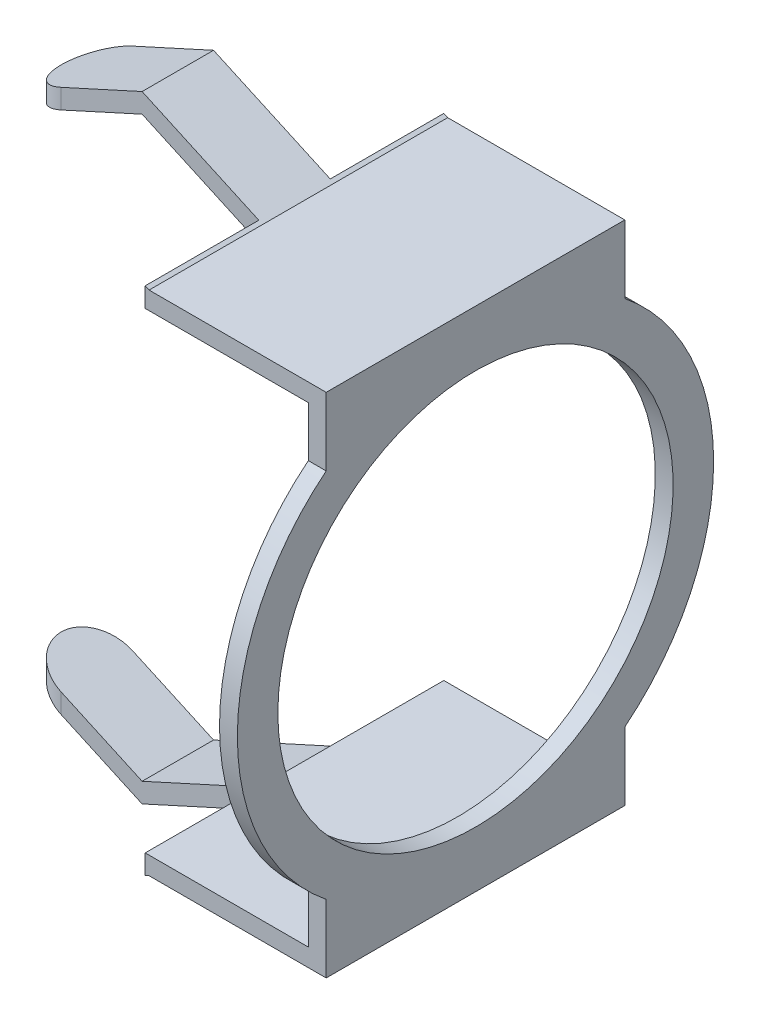
ISO-10303-21;
HEADER;
FILE_DESCRIPTION(('STEP AP214'),'2;1');
FILE_NAME('part.step','',(''),(''),'','','');
FILE_SCHEMA(('AUTOMOTIVE_DESIGN { 1 0 10303 214 1 1 1 1 }'));
ENDSEC;
DATA;
#1=APPLICATION_CONTEXT('core data for automotive mechanical design processes');
#2=APPLICATION_PROTOCOL_DEFINITION('international standard','automotive_design',2000,#1);
#3=PRODUCT_CONTEXT('',#1,'mechanical');
#4=PRODUCT('Part','Part','',(#3));
#5=PRODUCT_RELATED_PRODUCT_CATEGORY('part','',(#4));
#6=PRODUCT_DEFINITION_FORMATION('','',#4);
#7=PRODUCT_DEFINITION_CONTEXT('part definition',#1,'design');
#8=PRODUCT_DEFINITION('design','',#6,#7);
#9=PRODUCT_DEFINITION_SHAPE('','',#8);
#10=(LENGTH_UNIT() NAMED_UNIT(*) SI_UNIT(.MILLI.,.METRE.));
#11=(NAMED_UNIT(*) PLANE_ANGLE_UNIT() SI_UNIT($,.RADIAN.));
#12=(NAMED_UNIT(*) SI_UNIT($,.STERADIAN.) SOLID_ANGLE_UNIT());
#13=UNCERTAINTY_MEASURE_WITH_UNIT(LENGTH_MEASURE(1.E-05),#10,'distance_accuracy_value','');
#14=(GEOMETRIC_REPRESENTATION_CONTEXT(3) GLOBAL_UNCERTAINTY_ASSIGNED_CONTEXT((#13)) GLOBAL_UNIT_ASSIGNED_CONTEXT((#10,
#11,#12)) REPRESENTATION_CONTEXT('',''));
#15=CARTESIAN_POINT('',(0.,0.,0.));
#16=DIRECTION('',(0.,0.,1.));
#17=DIRECTION('',(1.,0.,0.));
#18=AXIS2_PLACEMENT_3D('',#15,#16,#17);
#19=CARTESIAN_POINT('',(2.025,-6.47700843453132,0.));
#20=DIRECTION('',(0.,-1.,0.));
#21=DIRECTION('',(0.,0.,-1.));
#22=AXIS2_PLACEMENT_3D('',#19,#20,#21);
#23=CYLINDRICAL_SURFACE('',#22,0.75);
#24=CARTESIAN_POINT('',(2.025,-5.70333496514356,0.));
#25=DIRECTION('',(0.414222746435424,0.910175541494878,0.));
#26=DIRECTION('',(0.910175541494878,-0.414222746435424,0.));
#27=AXIS2_PLACEMENT_3D('',#24,#25,#26);
#28=ELLIPSE('',#27,0.824016869062637,0.75);
#29=CARTESIAN_POINT('',(2.025,-5.70333496514356,-0.75));
#30=VERTEX_POINT('',#29);
#31=CARTESIAN_POINT('',(2.025,-5.70333496514356,0.75));
#32=VERTEX_POINT('',#31);
#33=EDGE_CURVE('E21',#30,#32,#28,.T.);
#34=ORIENTED_EDGE('',*,*,#33,.T.);
#35=DIRECTION('',(0.,-1.,0.));
#36=VECTOR('',#35,1.);
#37=CARTESIAN_POINT('',(2.025,-6.47700843453132,0.75));
#38=LINE('',#37,#36);
#39=CARTESIAN_POINT('',(2.025,-5.29132653061224,0.75));
#40=VERTEX_POINT('',#39);
#41=EDGE_CURVE('E187',#32,#40,#38,.F.);
#42=ORIENTED_EDGE('',*,*,#41,.T.);
#43=CARTESIAN_POINT('',(2.025,-5.29132653061224,0.));
#44=DIRECTION('',(0.414222746435424,0.910175541494878,0.));
#45=DIRECTION('',(0.910175541494878,-0.414222746435424,0.));
#46=AXIS2_PLACEMENT_3D('',#43,#44,#45);
#47=ELLIPSE('',#46,0.824016869062637,0.75);
#48=CARTESIAN_POINT('',(2.02500000000001,-5.29132653061224,-0.75));
#49=VERTEX_POINT('',#48);
#50=EDGE_CURVE('E182',#49,#40,#47,.T.);
#51=ORIENTED_EDGE('',*,*,#50,.F.);
#52=DIRECTION('',(0.,-1.,0.));
#53=VECTOR('',#52,1.);
#54=CARTESIAN_POINT('',(2.025,-6.47700843453132,-0.75));
#55=LINE('',#54,#53);
#56=EDGE_CURVE('E178',#49,#30,#55,.T.);
#57=ORIENTED_EDGE('',*,*,#56,.T.);
#58=EDGE_LOOP('',(#34,#42,#51,#57));
#59=FACE_BOUND('',#58,.T.);
#60=ADVANCED_FACE('F18',(#59),#23,.T.);
#61=CARTESIAN_POINT('',(2.025,-6.47700843453132,0.));
#62=DIRECTION('',(0.,-1.,0.));
#63=DIRECTION('',(0.,0.,-1.));
#64=AXIS2_PLACEMENT_3D('',#61,#62,#63);
#65=CYLINDRICAL_SURFACE('',#64,0.75);
#66=CARTESIAN_POINT('',(2.025,5.29132653061225,0.));
#67=DIRECTION('',(0.414222746435424,-0.910175541494878,0.));
#68=DIRECTION('',(-0.910175541494878,-0.414222746435424,0.));
#69=AXIS2_PLACEMENT_3D('',#66,#67,#68);
#70=ELLIPSE('',#69,0.824016869062637,0.75);
#71=CARTESIAN_POINT('',(2.02500000000001,5.29132653061225,0.75));
#72=VERTEX_POINT('',#71);
#73=CARTESIAN_POINT('',(2.02500000000001,5.29132653061225,-0.75));
#74=VERTEX_POINT('',#73);
#75=EDGE_CURVE('E284',#72,#74,#70,.T.);
#76=ORIENTED_EDGE('',*,*,#75,.F.);
#77=DIRECTION('',(0.,-1.,0.));
#78=VECTOR('',#77,1.);
#79=CARTESIAN_POINT('',(2.025,-6.47700843453132,0.75));
#80=LINE('',#79,#78);
#81=CARTESIAN_POINT('',(2.025,5.70333496514356,0.75));
#82=VERTEX_POINT('',#81);
#83=EDGE_CURVE('E216',#72,#82,#80,.F.);
#84=ORIENTED_EDGE('',*,*,#83,.T.);
#85=CARTESIAN_POINT('',(2.025,5.70333496514356,0.));
#86=DIRECTION('',(0.414222746435424,-0.910175541494878,0.));
#87=DIRECTION('',(-0.910175541494878,-0.414222746435424,0.));
#88=AXIS2_PLACEMENT_3D('',#85,#86,#87);
#89=ELLIPSE('',#88,0.824016869062637,0.75);
#90=CARTESIAN_POINT('',(2.025,5.70333496514356,-0.75));
#91=VERTEX_POINT('',#90);
#92=EDGE_CURVE('E289',#82,#91,#89,.T.);
#93=ORIENTED_EDGE('',*,*,#92,.T.);
#94=DIRECTION('',(0.,-1.,0.));
#95=VECTOR('',#94,1.);
#96=CARTESIAN_POINT('',(2.025,-6.47700843453132,-0.75));
#97=LINE('',#96,#95);
#98=EDGE_CURVE('E260',#91,#74,#97,.T.);
#99=ORIENTED_EDGE('',*,*,#98,.T.);
#100=EDGE_LOOP('',(#76,#84,#93,#99));
#101=FACE_BOUND('',#100,.T.);
#102=ADVANCED_FACE('F654',(#101),#65,.T.);
#103=CARTESIAN_POINT('',(1.11966647008672,-5.29131582806058,5.));
#104=DIRECTION('',(0.414222746435424,0.910175541494878,0.));
#105=DIRECTION('',(-0.910175541494878,0.414222746435424,0.));
#106=AXIS2_PLACEMENT_3D('',#103,#104,#105);
#107=PLANE('',#106);
#108=DIRECTION('',(0.910175541494878,-0.414222746435424,0.));
#109=VECTOR('',#108,1.);
#110=CARTESIAN_POINT('',(2.025,-5.70333496514356,-0.75));
#111=LINE('',#110,#109);
#112=CARTESIAN_POINT('',(3.725,-6.47700843453132,-0.750000000000001));
#113=VERTEX_POINT('',#112);
#114=EDGE_CURVE('E192',#30,#113,#111,.T.);
#115=ORIENTED_EDGE('',*,*,#114,.T.);
#116=DIRECTION('',(0.,0.,1.));
#117=VECTOR('',#116,1.);
#118=CARTESIAN_POINT('',(3.72500000000001,-6.47700843453132,5.));
#119=LINE('',#118,#117);
#120=CARTESIAN_POINT('',(3.725,-6.47700843453132,0.749999999999998));
#121=VERTEX_POINT('',#120);
#122=EDGE_CURVE('E197',#121,#113,#119,.F.);
#123=ORIENTED_EDGE('',*,*,#122,.F.);
#124=DIRECTION('',(-0.910175541494878,0.414222746435424,0.));
#125=VECTOR('',#124,1.);
#126=CARTESIAN_POINT('',(3.72500000000001,-6.47700843453132,0.75));
#127=LINE('',#126,#125);
#128=EDGE_CURVE('E195',#121,#32,#127,.T.);
#129=ORIENTED_EDGE('',*,*,#128,.T.);
#130=ORIENTED_EDGE('',*,*,#33,.F.);
#131=EDGE_LOOP('',(#115,#123,#129,#130));
#132=FACE_BOUND('',#131,.T.);
#133=ADVANCED_FACE('F191',(#132),#107,.F.);
#134=CARTESIAN_POINT('',(3.72500000000001,-6.065,5.));
#135=DIRECTION('',(-0.414222746435424,0.910175541494878,0.));
#136=DIRECTION('',(-0.910175541494878,-0.414222746435424,0.));
#137=AXIS2_PLACEMENT_3D('',#134,#135,#136);
#138=PLANE('',#137);
#139=DIRECTION('',(0.910175541494878,0.414222746435424,0.));
#140=VECTOR('',#139,1.);
#141=CARTESIAN_POINT('',(3.72500000000001,-6.065,0.75));
#142=LINE('',#141,#140);
#143=CARTESIAN_POINT('',(3.72500000000001,-6.065,0.749999999999998));
#144=VERTEX_POINT('',#143);
#145=CARTESIAN_POINT('',(6.17500000000001,-4.95,0.749999999999999));
#146=VERTEX_POINT('',#145);
#147=EDGE_CURVE('E239',#144,#146,#142,.T.);
#148=ORIENTED_EDGE('',*,*,#147,.T.);
#149=DIRECTION('',(0.,0.,1.));
#150=VECTOR('',#149,1.);
#151=CARTESIAN_POINT('',(6.17500000000001,-4.95,5.));
#152=LINE('',#151,#150);
#153=CARTESIAN_POINT('',(6.17500000000001,-4.95,-0.75));
#154=VERTEX_POINT('',#153);
#155=EDGE_CURVE('E196',#146,#154,#152,.F.);
#156=ORIENTED_EDGE('',*,*,#155,.T.);
#157=DIRECTION('',(-0.910175541494878,-0.414222746435424,0.));
#158=VECTOR('',#157,1.);
#159=CARTESIAN_POINT('',(6.17500000000001,-4.95,-0.75));
#160=LINE('',#159,#158);
#161=CARTESIAN_POINT('',(3.72500000000001,-6.065,-0.750000000000001));
#162=VERTEX_POINT('',#161);
#163=EDGE_CURVE('E205',#154,#162,#160,.T.);
#164=ORIENTED_EDGE('',*,*,#163,.T.);
#165=DIRECTION('',(0.,0.,1.));
#166=VECTOR('',#165,1.);
#167=CARTESIAN_POINT('',(3.72500000000001,-6.065,5.));
#168=LINE('',#167,#166);
#169=EDGE_CURVE('E291',#144,#162,#168,.F.);
#170=ORIENTED_EDGE('',*,*,#169,.F.);
#171=EDGE_LOOP('',(#148,#156,#164,#170));
#172=FACE_BOUND('',#171,.T.);
#173=ADVANCED_FACE('F463',(#172),#138,.T.);
#174=CARTESIAN_POINT('',(1.27500000000001,-4.95,5.));
#175=DIRECTION('',(0.414222746435424,0.910175541494878,0.));
#176=DIRECTION('',(-0.910175541494878,0.414222746435424,0.));
#177=AXIS2_PLACEMENT_3D('',#174,#175,#176);
#178=PLANE('',#177);
#179=DIRECTION('',(0.910175541494878,-0.414222746435425,0.));
#180=VECTOR('',#179,1.);
#181=CARTESIAN_POINT('',(2.025,-5.29132653061224,0.75));
#182=LINE('',#181,#180);
#183=EDGE_CURVE('E243',#40,#144,#182,.T.);
#184=ORIENTED_EDGE('',*,*,#183,.T.);
#185=ORIENTED_EDGE('',*,*,#169,.T.);
#186=DIRECTION('',(-0.910175541494878,0.414222746435425,0.));
#187=VECTOR('',#186,1.);
#188=CARTESIAN_POINT('',(3.72500000000001,-6.065,-0.75));
#189=LINE('',#188,#187);
#190=EDGE_CURVE('E382',#162,#49,#189,.T.);
#191=ORIENTED_EDGE('',*,*,#190,.T.);
#192=ORIENTED_EDGE('',*,*,#50,.T.);
#193=EDGE_LOOP('',(#184,#185,#191,#192));
#194=FACE_BOUND('',#193,.T.);
#195=ADVANCED_FACE('F465',(#194),#178,.T.);
#196=CARTESIAN_POINT('',(1.11966647008672,5.29131582806058,5.));
#197=DIRECTION('',(0.414222746435424,-0.910175541494878,0.));
#198=DIRECTION('',(0.910175541494878,0.414222746435424,0.));
#199=AXIS2_PLACEMENT_3D('',#196,#197,#198);
#200=PLANE('',#199);
#201=DIRECTION('',(-0.910175541494878,-0.414222746435424,0.));
#202=VECTOR('',#201,1.);
#203=CARTESIAN_POINT('',(3.72500000000001,6.47700843453132,-0.75));
#204=LINE('',#203,#202);
#205=CARTESIAN_POINT('',(3.72500000000001,6.47700843453132,-0.750000000000001));
#206=VERTEX_POINT('',#205);
#207=EDGE_CURVE('E414',#206,#91,#204,.T.);
#208=ORIENTED_EDGE('',*,*,#207,.T.);
#209=ORIENTED_EDGE('',*,*,#92,.F.);
#210=DIRECTION('',(0.910175541494878,0.414222746435423,0.));
#211=VECTOR('',#210,1.);
#212=CARTESIAN_POINT('',(2.025,5.70333496514356,0.75));
#213=LINE('',#212,#211);
#214=CARTESIAN_POINT('',(3.72500000000001,6.47700843453132,0.749999999999998));
#215=VERTEX_POINT('',#214);
#216=EDGE_CURVE('E419',#82,#215,#213,.T.);
#217=ORIENTED_EDGE('',*,*,#216,.T.);
#218=DIRECTION('',(0.,0.,1.));
#219=VECTOR('',#218,1.);
#220=CARTESIAN_POINT('',(3.72500000000001,6.47700843453132,5.));
#221=LINE('',#220,#219);
#222=EDGE_CURVE('E288',#206,#215,#221,.T.);
#223=ORIENTED_EDGE('',*,*,#222,.F.);
#224=EDGE_LOOP('',(#208,#209,#217,#223));
#225=FACE_BOUND('',#224,.T.);
#226=ADVANCED_FACE('F686',(#225),#200,.F.);
#227=CARTESIAN_POINT('',(1.27500000000001,4.95,5.));
#228=DIRECTION('',(0.414222746435424,-0.910175541494878,0.));
#229=DIRECTION('',(0.910175541494878,0.414222746435424,0.));
#230=AXIS2_PLACEMENT_3D('',#227,#228,#229);
#231=PLANE('',#230);
#232=DIRECTION('',(-0.910175541494878,-0.414222746435424,0.));
#233=VECTOR('',#232,1.);
#234=CARTESIAN_POINT('',(3.72500000000001,6.065,0.75));
#235=LINE('',#234,#233);
#236=CARTESIAN_POINT('',(3.72500000000001,6.065,0.749999999999998));
#237=VERTEX_POINT('',#236);
#238=EDGE_CURVE('E427',#237,#72,#235,.T.);
#239=ORIENTED_EDGE('',*,*,#238,.T.);
#240=ORIENTED_EDGE('',*,*,#75,.T.);
#241=DIRECTION('',(0.910175541494878,0.414222746435424,0.));
#242=VECTOR('',#241,1.);
#243=CARTESIAN_POINT('',(2.025,5.29132653061225,-0.75));
#244=LINE('',#243,#242);
#245=CARTESIAN_POINT('',(3.725,6.065,-0.750000000000001));
#246=VERTEX_POINT('',#245);
#247=EDGE_CURVE('E398',#74,#246,#244,.T.);
#248=ORIENTED_EDGE('',*,*,#247,.T.);
#249=DIRECTION('',(0.,0.,1.));
#250=VECTOR('',#249,1.);
#251=CARTESIAN_POINT('',(3.72500000000001,6.065,5.));
#252=LINE('',#251,#250);
#253=EDGE_CURVE('E256',#237,#246,#252,.F.);
#254=ORIENTED_EDGE('',*,*,#253,.F.);
#255=EDGE_LOOP('',(#239,#240,#248,#254));
#256=FACE_BOUND('',#255,.T.);
#257=ADVANCED_FACE('F695',(#256),#231,.T.);
#258=CARTESIAN_POINT('',(3.72500000000001,6.065,5.));
#259=DIRECTION('',(-0.414222746435424,-0.910175541494878,0.));
#260=DIRECTION('',(0.910175541494878,-0.414222746435424,0.));
#261=AXIS2_PLACEMENT_3D('',#258,#259,#260);
#262=PLANE('',#261);
#263=DIRECTION('',(-0.910175541494878,0.414222746435425,0.));
#264=VECTOR('',#263,1.);
#265=CARTESIAN_POINT('',(6.17500000000001,4.95,0.75));
#266=LINE('',#265,#264);
#267=CARTESIAN_POINT('',(6.17500000000001,4.95,0.749999999999999));
#268=VERTEX_POINT('',#267);
#269=EDGE_CURVE('E436',#268,#237,#266,.T.);
#270=ORIENTED_EDGE('',*,*,#269,.T.);
#271=ORIENTED_EDGE('',*,*,#253,.T.);
#272=DIRECTION('',(0.910175541494878,-0.414222746435424,0.));
#273=VECTOR('',#272,1.);
#274=CARTESIAN_POINT('',(3.72500000000001,6.065,-0.75));
#275=LINE('',#274,#273);
#276=CARTESIAN_POINT('',(6.17500000000001,4.95,-0.750000000000001));
#277=VERTEX_POINT('',#276);
#278=EDGE_CURVE('E376',#246,#277,#275,.T.);
#279=ORIENTED_EDGE('',*,*,#278,.T.);
#280=DIRECTION('',(0.,0.,1.));
#281=VECTOR('',#280,1.);
#282=CARTESIAN_POINT('',(6.17500000000001,4.95,5.));
#283=LINE('',#282,#281);
#284=EDGE_CURVE('E287',#277,#268,#283,.T.);
#285=ORIENTED_EDGE('',*,*,#284,.T.);
#286=EDGE_LOOP('',(#270,#271,#279,#285));
#287=FACE_BOUND('',#286,.T.);
#288=ADVANCED_FACE('F705',(#287),#262,.T.);
#289=CARTESIAN_POINT('',(2.025,-6.47700843453132,0.75));
#290=DIRECTION('',(0.,0.,-1.));
#291=DIRECTION('',(-1.,0.,0.));
#292=AXIS2_PLACEMENT_3D('',#289,#290,#291);
#293=PLANE('',#292);
#294=DIRECTION('',(0.,1.,0.));
#295=VECTOR('',#294,1.);
#296=CARTESIAN_POINT('',(6.17500000000001,-6.47700843453132,0.75));
#297=LINE('',#296,#295);
#298=CARTESIAN_POINT('',(6.17500000000001,-5.36200843453132,0.749999999999999));
#299=VERTEX_POINT('',#298);
#300=EDGE_CURVE('E242',#299,#146,#297,.T.);
#301=ORIENTED_EDGE('',*,*,#300,.T.);
#302=ORIENTED_EDGE('',*,*,#147,.F.);
#303=ORIENTED_EDGE('',*,*,#183,.F.);
#304=ORIENTED_EDGE('',*,*,#41,.F.);
#305=ORIENTED_EDGE('',*,*,#128,.F.);
#306=DIRECTION('',(-0.910175541494878,-0.414222746435424,0.));
#307=VECTOR('',#306,1.);
#308=CARTESIAN_POINT('',(3.88033352991329,-6.40631582806058,0.749999999999998));
#309=LINE('',#308,#307);
#310=EDGE_CURVE('E230',#121,#299,#309,.F.);
#311=ORIENTED_EDGE('',*,*,#310,.T.);
#312=EDGE_LOOP('',(#301,#302,#303,#304,#305,#311));
#313=FACE_BOUND('',#312,.T.);
#314=ADVANCED_FACE('F468',(#313),#293,.F.);
#315=CARTESIAN_POINT('',(6.17500000000001,-6.47700843453132,0.75));
#316=DIRECTION('',(1.,0.,0.));
#317=DIRECTION('',(0.,0.,-1.));
#318=AXIS2_PLACEMENT_3D('',#315,#316,#317);
#319=PLANE('',#318);
#320=DIRECTION('',(0.,0.,1.));
#321=VECTOR('',#320,1.);
#322=CARTESIAN_POINT('',(6.17500000000001,-4.95,5.));
#323=LINE('',#322,#321);
#324=CARTESIAN_POINT('',(6.17500000000001,-4.95,3.135));
#325=VERTEX_POINT('',#324);
#326=EDGE_CURVE('E248',#146,#325,#323,.T.);
#327=ORIENTED_EDGE('',*,*,#326,.F.);
#328=ORIENTED_EDGE('',*,*,#300,.F.);
#329=DIRECTION('',(0.,0.,1.));
#330=VECTOR('',#329,1.);
#331=CARTESIAN_POINT('',(6.17500000000001,-5.36200843453132,5.));
#332=LINE('',#331,#330);
#333=CARTESIAN_POINT('',(6.17500000000001,-5.36200843453132,3.135));
#334=VERTEX_POINT('',#333);
#335=EDGE_CURVE('E226',#299,#334,#332,.T.);
#336=ORIENTED_EDGE('',*,*,#335,.T.);
#337=DIRECTION('',(0.,1.,0.));
#338=VECTOR('',#337,1.);
#339=CARTESIAN_POINT('',(6.17500000000001,-6.47700843453132,3.135));
#340=LINE('',#339,#338);
#341=EDGE_CURVE('E207',#325,#334,#340,.F.);
#342=ORIENTED_EDGE('',*,*,#341,.F.);
#343=EDGE_LOOP('',(#327,#328,#336,#342));
#344=FACE_BOUND('',#343,.T.);
#345=ADVANCED_FACE('F473',(#344),#319,.F.);
#346=CARTESIAN_POINT('',(6.17500000000001,-6.47700843453132,-0.75));
#347=DIRECTION('',(1.,0.,0.));
#348=DIRECTION('',(0.,0.,-1.));
#349=AXIS2_PLACEMENT_3D('',#346,#347,#348);
#350=PLANE('',#349);
#351=DIRECTION('',(0.,0.,1.));
#352=VECTOR('',#351,1.);
#353=CARTESIAN_POINT('',(6.17500000000001,-4.95,5.));
#354=LINE('',#353,#352);
#355=CARTESIAN_POINT('',(6.175,-4.95,-3.135));
#356=VERTEX_POINT('',#355);
#357=EDGE_CURVE('E344',#356,#154,#354,.T.);
#358=ORIENTED_EDGE('',*,*,#357,.F.);
#359=DIRECTION('',(0.,1.,0.));
#360=VECTOR('',#359,1.);
#361=CARTESIAN_POINT('',(6.17500000000001,-6.47700843453132,-3.135));
#362=LINE('',#361,#360);
#363=CARTESIAN_POINT('',(6.17500000000001,-5.36200843453132,-3.135));
#364=VERTEX_POINT('',#363);
#365=EDGE_CURVE('E202',#364,#356,#362,.T.);
#366=ORIENTED_EDGE('',*,*,#365,.F.);
#367=DIRECTION('',(0.,0.,1.));
#368=VECTOR('',#367,1.);
#369=CARTESIAN_POINT('',(6.17500000000001,-5.36200843453132,5.));
#370=LINE('',#369,#368);
#371=CARTESIAN_POINT('',(6.17500000000001,-5.36200843453132,-0.75));
#372=VERTEX_POINT('',#371);
#373=EDGE_CURVE('E229',#364,#372,#370,.T.);
#374=ORIENTED_EDGE('',*,*,#373,.T.);
#375=DIRECTION('',(0.,1.,0.));
#376=VECTOR('',#375,1.);
#377=CARTESIAN_POINT('',(6.17500000000001,-6.47700843453132,-0.75));
#378=LINE('',#377,#376);
#379=EDGE_CURVE('E201',#372,#154,#378,.T.);
#380=ORIENTED_EDGE('',*,*,#379,.T.);
#381=EDGE_LOOP('',(#358,#366,#374,#380));
#382=FACE_BOUND('',#381,.T.);
#383=ADVANCED_FACE('F313',(#382),#350,.F.);
#384=CARTESIAN_POINT('',(2.025,-6.47700843453132,-0.75));
#385=DIRECTION('',(0.,0.,1.));
#386=DIRECTION('',(1.,0.,0.));
#387=AXIS2_PLACEMENT_3D('',#384,#385,#386);
#388=PLANE('',#387);
#389=ORIENTED_EDGE('',*,*,#190,.F.);
#390=ORIENTED_EDGE('',*,*,#163,.F.);
#391=ORIENTED_EDGE('',*,*,#379,.F.);
#392=DIRECTION('',(-0.910175541494878,-0.414222746435424,0.));
#393=VECTOR('',#392,1.);
#394=CARTESIAN_POINT('',(3.88033352991329,-6.40631582806058,-0.750000000000002));
#395=LINE('',#394,#393);
#396=EDGE_CURVE('E200',#372,#113,#395,.T.);
#397=ORIENTED_EDGE('',*,*,#396,.T.);
#398=ORIENTED_EDGE('',*,*,#114,.F.);
#399=ORIENTED_EDGE('',*,*,#56,.F.);
#400=EDGE_LOOP('',(#389,#390,#391,#397,#398,#399));
#401=FACE_BOUND('',#400,.T.);
#402=ADVANCED_FACE('F198',(#401),#388,.F.);
#403=CARTESIAN_POINT('',(6.17500000000001,-6.47700843453132,0.75));
#404=DIRECTION('',(1.,0.,0.));
#405=DIRECTION('',(0.,0.,-1.));
#406=AXIS2_PLACEMENT_3D('',#403,#404,#405);
#407=PLANE('',#406);
#408=DIRECTION('',(0.,0.,-1.));
#409=VECTOR('',#408,1.);
#410=CARTESIAN_POINT('',(6.17500000000001,4.95,5.));
#411=LINE('',#410,#409);
#412=CARTESIAN_POINT('',(6.175,4.95,3.135));
#413=VERTEX_POINT('',#412);
#414=EDGE_CURVE('E370',#413,#268,#411,.T.);
#415=ORIENTED_EDGE('',*,*,#414,.F.);
#416=DIRECTION('',(0.,1.,0.));
#417=VECTOR('',#416,1.);
#418=CARTESIAN_POINT('',(6.17500000000001,-6.47700843453132,3.135));
#419=LINE('',#418,#417);
#420=CARTESIAN_POINT('',(6.17500000000001,5.36200843453132,3.135));
#421=VERTEX_POINT('',#420);
#422=EDGE_CURVE('E379',#421,#413,#419,.F.);
#423=ORIENTED_EDGE('',*,*,#422,.F.);
#424=DIRECTION('',(0.,0.,1.));
#425=VECTOR('',#424,1.);
#426=CARTESIAN_POINT('',(6.17500000000001,5.36200843453132,5.));
#427=LINE('',#426,#425);
#428=CARTESIAN_POINT('',(6.17500000000001,5.36200843453132,0.749999999999999));
#429=VERTEX_POINT('',#428);
#430=EDGE_CURVE('E222',#421,#429,#427,.F.);
#431=ORIENTED_EDGE('',*,*,#430,.T.);
#432=DIRECTION('',(0.,1.,0.));
#433=VECTOR('',#432,1.);
#434=CARTESIAN_POINT('',(6.17500000000001,-6.47700843453132,0.75));
#435=LINE('',#434,#433);
#436=EDGE_CURVE('E381',#429,#268,#435,.F.);
#437=ORIENTED_EDGE('',*,*,#436,.T.);
#438=EDGE_LOOP('',(#415,#423,#431,#437));
#439=FACE_BOUND('',#438,.T.);
#440=ADVANCED_FACE('F600',(#439),#407,.F.);
#441=CARTESIAN_POINT('',(2.025,-6.47700843453132,0.75));
#442=DIRECTION('',(0.,0.,-1.));
#443=DIRECTION('',(-1.,0.,0.));
#444=AXIS2_PLACEMENT_3D('',#441,#442,#443);
#445=PLANE('',#444);
#446=ORIENTED_EDGE('',*,*,#83,.F.);
#447=ORIENTED_EDGE('',*,*,#238,.F.);
#448=ORIENTED_EDGE('',*,*,#269,.F.);
#449=ORIENTED_EDGE('',*,*,#436,.F.);
#450=DIRECTION('',(0.910175541494878,-0.414222746435424,0.));
#451=VECTOR('',#450,1.);
#452=CARTESIAN_POINT('',(3.88033352991329,6.40631582806058,0.749999999999998));
#453=LINE('',#452,#451);
#454=EDGE_CURVE('E403',#429,#215,#453,.F.);
#455=ORIENTED_EDGE('',*,*,#454,.T.);
#456=ORIENTED_EDGE('',*,*,#216,.F.);
#457=EDGE_LOOP('',(#446,#447,#448,#449,#455,#456));
#458=FACE_BOUND('',#457,.T.);
#459=ADVANCED_FACE('F597',(#458),#445,.F.);
#460=CARTESIAN_POINT('',(2.025,-6.47700843453132,-0.75));
#461=DIRECTION('',(0.,0.,1.));
#462=DIRECTION('',(1.,0.,0.));
#463=AXIS2_PLACEMENT_3D('',#460,#461,#462);
#464=PLANE('',#463);
#465=ORIENTED_EDGE('',*,*,#278,.F.);
#466=ORIENTED_EDGE('',*,*,#247,.F.);
#467=ORIENTED_EDGE('',*,*,#98,.F.);
#468=ORIENTED_EDGE('',*,*,#207,.F.);
#469=DIRECTION('',(0.910175541494878,-0.414222746435424,0.));
#470=VECTOR('',#469,1.);
#471=CARTESIAN_POINT('',(3.88033352991329,6.40631582806058,-0.750000000000002));
#472=LINE('',#471,#470);
#473=CARTESIAN_POINT('',(6.17500000000001,5.36200843453132,-0.750000000000001));
#474=VERTEX_POINT('',#473);
#475=EDGE_CURVE('E389',#206,#474,#472,.T.);
#476=ORIENTED_EDGE('',*,*,#475,.T.);
#477=DIRECTION('',(0.,1.,0.));
#478=VECTOR('',#477,1.);
#479=CARTESIAN_POINT('',(6.17500000000001,-6.47700843453132,-0.75));
#480=LINE('',#479,#478);
#481=EDGE_CURVE('E371',#474,#277,#480,.F.);
#482=ORIENTED_EDGE('',*,*,#481,.T.);
#483=EDGE_LOOP('',(#465,#466,#467,#468,#476,#482));
#484=FACE_BOUND('',#483,.T.);
#485=ADVANCED_FACE('F754',(#484),#464,.F.);
#486=CARTESIAN_POINT('',(6.17500000000001,-6.47700843453132,-0.75));
#487=DIRECTION('',(1.,0.,0.));
#488=DIRECTION('',(0.,0.,-1.));
#489=AXIS2_PLACEMENT_3D('',#486,#487,#488);
#490=PLANE('',#489);
#491=DIRECTION('',(0.,0.,-1.));
#492=VECTOR('',#491,1.);
#493=CARTESIAN_POINT('',(6.17500000000001,4.95,5.));
#494=LINE('',#493,#492);
#495=CARTESIAN_POINT('',(6.175,4.95,-3.135));
#496=VERTEX_POINT('',#495);
#497=EDGE_CURVE('E346',#277,#496,#494,.T.);
#498=ORIENTED_EDGE('',*,*,#497,.F.);
#499=ORIENTED_EDGE('',*,*,#481,.F.);
#500=DIRECTION('',(0.,0.,1.));
#501=VECTOR('',#500,1.);
#502=CARTESIAN_POINT('',(6.175,5.36200843453132,5.));
#503=LINE('',#502,#501);
#504=CARTESIAN_POINT('',(6.17500000000001,5.36200843453132,-3.135));
#505=VERTEX_POINT('',#504);
#506=EDGE_CURVE('E385',#474,#505,#503,.F.);
#507=ORIENTED_EDGE('',*,*,#506,.T.);
#508=DIRECTION('',(0.,1.,0.));
#509=VECTOR('',#508,1.);
#510=CARTESIAN_POINT('',(6.17500000000001,-6.47700843453132,-3.135));
#511=LINE('',#510,#509);
#512=EDGE_CURVE('E368',#496,#505,#511,.T.);
#513=ORIENTED_EDGE('',*,*,#512,.F.);
#514=EDGE_LOOP('',(#498,#499,#507,#513));
#515=FACE_BOUND('',#514,.T.);
#516=ADVANCED_FACE('F749',(#515),#490,.F.);
#517=CARTESIAN_POINT('',(6.17500000000001,4.95,5.));
#518=DIRECTION('',(0.,-1.,0.));
#519=DIRECTION('',(0.,0.,-1.));
#520=AXIS2_PLACEMENT_3D('',#517,#518,#519);
#521=PLANE('',#520);
#522=ORIENTED_EDGE('',*,*,#497,.T.);
#523=DIRECTION('',(1.,0.,0.));
#524=VECTOR('',#523,1.);
#525=CARTESIAN_POINT('',(1.27500000000001,4.95,-3.135));
#526=LINE('',#525,#524);
#527=CARTESIAN_POINT('',(9.6,4.95,-3.135));
#528=VERTEX_POINT('',#527);
#529=EDGE_CURVE('E500',#528,#496,#526,.F.);
#530=ORIENTED_EDGE('',*,*,#529,.F.);
#531=DIRECTION('',(0.,0.,1.));
#532=VECTOR('',#531,1.);
#533=CARTESIAN_POINT('',(9.6,4.95,5.));
#534=LINE('',#533,#532);
#535=CARTESIAN_POINT('',(9.6,4.95,3.135));
#536=VERTEX_POINT('',#535);
#537=EDGE_CURVE('E454',#536,#528,#534,.F.);
#538=ORIENTED_EDGE('',*,*,#537,.F.);
#539=DIRECTION('',(1.,0.,0.));
#540=VECTOR('',#539,1.);
#541=CARTESIAN_POINT('',(1.27500000000001,4.95,3.135));
#542=LINE('',#541,#540);
#543=EDGE_CURVE('E503',#413,#536,#542,.T.);
#544=ORIENTED_EDGE('',*,*,#543,.F.);
#545=ORIENTED_EDGE('',*,*,#414,.T.);
#546=ORIENTED_EDGE('',*,*,#284,.F.);
#547=EDGE_LOOP('',(#522,#530,#538,#544,#545,#546));
#548=FACE_BOUND('',#547,.T.);
#549=ADVANCED_FACE('F577',(#548),#521,.T.);
#550=CARTESIAN_POINT('',(6.17500000000001,-4.95,5.));
#551=DIRECTION('',(0.,1.,0.));
#552=DIRECTION('',(0.,0.,1.));
#553=AXIS2_PLACEMENT_3D('',#550,#551,#552);
#554=PLANE('',#553);
#555=ORIENTED_EDGE('',*,*,#326,.T.);
#556=DIRECTION('',(1.,0.,0.));
#557=VECTOR('',#556,1.);
#558=CARTESIAN_POINT('',(1.27500000000001,-4.95,3.135));
#559=LINE('',#558,#557);
#560=CARTESIAN_POINT('',(9.6,-4.95,3.135));
#561=VERTEX_POINT('',#560);
#562=EDGE_CURVE('E479',#561,#325,#559,.F.);
#563=ORIENTED_EDGE('',*,*,#562,.F.);
#564=DIRECTION('',(0.,0.,1.));
#565=VECTOR('',#564,1.);
#566=CARTESIAN_POINT('',(9.6,-4.95,5.));
#567=LINE('',#566,#565);
#568=CARTESIAN_POINT('',(9.6,-4.95,-3.135));
#569=VERTEX_POINT('',#568);
#570=EDGE_CURVE('E493',#569,#561,#567,.T.);
#571=ORIENTED_EDGE('',*,*,#570,.F.);
#572=DIRECTION('',(1.,0.,0.));
#573=VECTOR('',#572,1.);
#574=CARTESIAN_POINT('',(1.27500000000001,-4.95,-3.135));
#575=LINE('',#574,#573);
#576=EDGE_CURVE('E485',#356,#569,#575,.T.);
#577=ORIENTED_EDGE('',*,*,#576,.F.);
#578=ORIENTED_EDGE('',*,*,#357,.T.);
#579=ORIENTED_EDGE('',*,*,#155,.F.);
#580=EDGE_LOOP('',(#555,#563,#571,#577,#578,#579));
#581=FACE_BOUND('',#580,.T.);
#582=ADVANCED_FACE('F477',(#581),#554,.T.);
#583=CARTESIAN_POINT('',(3.88033352991329,-6.40631582806058,5.));
#584=DIRECTION('',(-0.414222746435424,0.910175541494878,0.));
#585=DIRECTION('',(-0.910175541494878,-0.414222746435424,0.));
#586=AXIS2_PLACEMENT_3D('',#583,#584,#585);
#587=PLANE('',#586);
#588=ORIENTED_EDGE('',*,*,#373,.F.);
#589=DIRECTION('',(-0.910175541494885,-0.41422274643541,0.));
#590=VECTOR('',#589,1.);
#591=CARTESIAN_POINT('',(6.25631898170559,-5.325,-3.135));
#592=LINE('',#591,#590);
#593=CARTESIAN_POINT('',(6.25631898170559,-5.325,-3.135));
#594=VERTEX_POINT('',#593);
#595=EDGE_CURVE('E219',#594,#364,#592,.T.);
#596=ORIENTED_EDGE('',*,*,#595,.F.);
#597=DIRECTION('',(0.,0.,1.));
#598=VECTOR('',#597,1.);
#599=CARTESIAN_POINT('',(6.25631898170559,-5.325,5.));
#600=LINE('',#599,#598);
#601=CARTESIAN_POINT('',(6.25631898170559,-5.325,3.135));
#602=VERTEX_POINT('',#601);
#603=EDGE_CURVE('E333',#594,#602,#600,.T.);
#604=ORIENTED_EDGE('',*,*,#603,.T.);
#605=DIRECTION('',(0.910175541494883,0.414222746435413,0.));
#606=VECTOR('',#605,1.);
#607=CARTESIAN_POINT('',(6.17500000000001,-5.36200843453132,3.135));
#608=LINE('',#607,#606);
#609=EDGE_CURVE('E233',#334,#602,#608,.T.);
#610=ORIENTED_EDGE('',*,*,#609,.F.);
#611=ORIENTED_EDGE('',*,*,#335,.F.);
#612=ORIENTED_EDGE('',*,*,#310,.F.);
#613=ORIENTED_EDGE('',*,*,#122,.T.);
#614=ORIENTED_EDGE('',*,*,#396,.F.);
#615=EDGE_LOOP('',(#588,#596,#604,#610,#611,#612,#613,#614));
#616=FACE_BOUND('',#615,.T.);
#617=ADVANCED_FACE('F316',(#616),#587,.F.);
#618=CARTESIAN_POINT('',(1.27500000000001,-3.8950962760887,3.135));
#619=DIRECTION('',(0.,0.,1.));
#620=DIRECTION('',(0.,-1.,0.));
#621=AXIS2_PLACEMENT_3D('',#618,#619,#620);
#622=PLANE('',#621);
#623=DIRECTION('',(0.,1.,0.));
#624=VECTOR('',#623,1.);
#625=CARTESIAN_POINT('',(9.6,4.95,3.135));
#626=LINE('',#625,#624);
#627=CARTESIAN_POINT('',(9.6,-3.8950962760887,3.135));
#628=VERTEX_POINT('',#627);
#629=EDGE_CURVE('E484',#561,#628,#626,.T.);
#630=ORIENTED_EDGE('',*,*,#629,.F.);
#631=ORIENTED_EDGE('',*,*,#562,.T.);
#632=ORIENTED_EDGE('',*,*,#341,.T.);
#633=ORIENTED_EDGE('',*,*,#609,.T.);
#634=DIRECTION('',(1.,0.,0.));
#635=VECTOR('',#634,1.);
#636=CARTESIAN_POINT('',(6.17500000000001,-5.325,3.135));
#637=LINE('',#636,#635);
#638=CARTESIAN_POINT('',(9.975,-5.325,3.135));
#639=VERTEX_POINT('',#638);
#640=EDGE_CURVE('E329',#602,#639,#637,.T.);
#641=ORIENTED_EDGE('',*,*,#640,.T.);
#642=DIRECTION('',(0.,-1.,0.));
#643=VECTOR('',#642,1.);
#644=CARTESIAN_POINT('',(9.975,-3.8950962760887,3.135));
#645=LINE('',#644,#643);
#646=CARTESIAN_POINT('',(9.975,-3.8950962760887,3.135));
#647=VERTEX_POINT('',#646);
#648=EDGE_CURVE('E236',#639,#647,#645,.F.);
#649=ORIENTED_EDGE('',*,*,#648,.T.);
#650=DIRECTION('',(1.,0.,0.));
#651=VECTOR('',#650,1.);
#652=CARTESIAN_POINT('',(1.27500000000001,-3.8950962760887,3.135));
#653=LINE('',#652,#651);
#654=EDGE_CURVE('E354',#647,#628,#653,.F.);
#655=ORIENTED_EDGE('',*,*,#654,.T.);
#656=EDGE_LOOP('',(#630,#631,#632,#633,#641,#649,#655));
#657=FACE_BOUND('',#656,.T.);
#658=ADVANCED_FACE('F482',(#657),#622,.T.);
#659=CARTESIAN_POINT('',(1.27500000000001,-3.8950962760887,-3.135));
#660=DIRECTION('',(0.,0.,-1.));
#661=DIRECTION('',(0.,1.,0.));
#662=AXIS2_PLACEMENT_3D('',#659,#660,#661);
#663=PLANE('',#662);
#664=DIRECTION('',(1.,0.,0.));
#665=VECTOR('',#664,1.);
#666=CARTESIAN_POINT('',(6.17500000000001,-5.325,-3.135));
#667=LINE('',#666,#665);
#668=CARTESIAN_POINT('',(9.975,-5.325,-3.135));
#669=VERTEX_POINT('',#668);
#670=EDGE_CURVE('E322',#669,#594,#667,.F.);
#671=ORIENTED_EDGE('',*,*,#670,.T.);
#672=ORIENTED_EDGE('',*,*,#595,.T.);
#673=ORIENTED_EDGE('',*,*,#365,.T.);
#674=ORIENTED_EDGE('',*,*,#576,.T.);
#675=DIRECTION('',(0.,1.,0.));
#676=VECTOR('',#675,1.);
#677=CARTESIAN_POINT('',(9.6,4.95,-3.135));
#678=LINE('',#677,#676);
#679=CARTESIAN_POINT('',(9.6,-3.8950962760887,-3.135));
#680=VERTEX_POINT('',#679);
#681=EDGE_CURVE('E495',#680,#569,#678,.F.);
#682=ORIENTED_EDGE('',*,*,#681,.F.);
#683=DIRECTION('',(-1.,0.,0.));
#684=VECTOR('',#683,1.);
#685=CARTESIAN_POINT('',(1.27500000000001,-3.8950962760887,-3.135));
#686=LINE('',#685,#684);
#687=CARTESIAN_POINT('',(9.975,-3.8950962760887,-3.135));
#688=VERTEX_POINT('',#687);
#689=EDGE_CURVE('E532',#688,#680,#686,.T.);
#690=ORIENTED_EDGE('',*,*,#689,.F.);
#691=DIRECTION('',(0.,1.,0.));
#692=VECTOR('',#691,1.);
#693=CARTESIAN_POINT('',(9.975,-3.8950962760887,-3.135));
#694=LINE('',#693,#692);
#695=EDGE_CURVE('E223',#688,#669,#694,.F.);
#696=ORIENTED_EDGE('',*,*,#695,.T.);
#697=EDGE_LOOP('',(#671,#672,#673,#674,#682,#690,#696));
#698=FACE_BOUND('',#697,.T.);
#699=ADVANCED_FACE('F320',(#698),#663,.T.);
#700=CARTESIAN_POINT('',(3.88033352991329,6.40631582806058,5.));
#701=DIRECTION('',(-0.414222746435424,-0.910175541494878,0.));
#702=DIRECTION('',(0.910175541494878,-0.414222746435424,0.));
#703=AXIS2_PLACEMENT_3D('',#700,#701,#702);
#704=PLANE('',#703);
#705=ORIENTED_EDGE('',*,*,#506,.F.);
#706=ORIENTED_EDGE('',*,*,#475,.F.);
#707=ORIENTED_EDGE('',*,*,#222,.T.);
#708=ORIENTED_EDGE('',*,*,#454,.F.);
#709=ORIENTED_EDGE('',*,*,#430,.F.);
#710=DIRECTION('',(-0.910175541494877,0.414222746435426,0.));
#711=VECTOR('',#710,1.);
#712=CARTESIAN_POINT('',(6.25631898170559,5.325,3.135));
#713=LINE('',#712,#711);
#714=CARTESIAN_POINT('',(6.25631898170559,5.325,3.135));
#715=VERTEX_POINT('',#714);
#716=EDGE_CURVE('E451',#715,#421,#713,.T.);
#717=ORIENTED_EDGE('',*,*,#716,.F.);
#718=DIRECTION('',(0.,0.,-1.));
#719=VECTOR('',#718,1.);
#720=CARTESIAN_POINT('',(6.25631898170559,5.325,5.));
#721=LINE('',#720,#719);
#722=CARTESIAN_POINT('',(6.25631898170559,5.325,-3.135));
#723=VERTEX_POINT('',#722);
#724=EDGE_CURVE('E277',#715,#723,#721,.T.);
#725=ORIENTED_EDGE('',*,*,#724,.T.);
#726=DIRECTION('',(0.910175541494883,-0.414222746435413,0.));
#727=VECTOR('',#726,1.);
#728=CARTESIAN_POINT('',(6.17500000000001,5.36200843453132,-3.135));
#729=LINE('',#728,#727);
#730=EDGE_CURVE('E388',#505,#723,#729,.T.);
#731=ORIENTED_EDGE('',*,*,#730,.F.);
#732=EDGE_LOOP('',(#705,#706,#707,#708,#709,#717,#725,#731));
#733=FACE_BOUND('',#732,.T.);
#734=ADVANCED_FACE('F603',(#733),#704,.F.);
#735=CARTESIAN_POINT('',(1.27500000000001,3.8950962760887,-3.135));
#736=DIRECTION('',(0.,0.,-1.));
#737=DIRECTION('',(0.,1.,0.));
#738=AXIS2_PLACEMENT_3D('',#735,#736,#737);
#739=PLANE('',#738);
#740=DIRECTION('',(0.,1.,0.));
#741=VECTOR('',#740,1.);
#742=CARTESIAN_POINT('',(9.6,4.95,-3.135));
#743=LINE('',#742,#741);
#744=CARTESIAN_POINT('',(9.6,3.8950962760887,-3.135));
#745=VERTEX_POINT('',#744);
#746=EDGE_CURVE('E546',#528,#745,#743,.F.);
#747=ORIENTED_EDGE('',*,*,#746,.F.);
#748=ORIENTED_EDGE('',*,*,#529,.T.);
#749=ORIENTED_EDGE('',*,*,#512,.T.);
#750=ORIENTED_EDGE('',*,*,#730,.T.);
#751=DIRECTION('',(1.,0.,0.));
#752=VECTOR('',#751,1.);
#753=CARTESIAN_POINT('',(6.17500000000001,5.325,-3.135));
#754=LINE('',#753,#752);
#755=CARTESIAN_POINT('',(9.975,5.325,-3.135));
#756=VERTEX_POINT('',#755);
#757=EDGE_CURVE('E508',#723,#756,#754,.T.);
#758=ORIENTED_EDGE('',*,*,#757,.T.);
#759=DIRECTION('',(0.,1.,0.));
#760=VECTOR('',#759,1.);
#761=CARTESIAN_POINT('',(9.975,3.8950962760887,-3.135));
#762=LINE('',#761,#760);
#763=CARTESIAN_POINT('',(9.975,3.8950962760887,-3.135));
#764=VERTEX_POINT('',#763);
#765=EDGE_CURVE('E36',#756,#764,#762,.F.);
#766=ORIENTED_EDGE('',*,*,#765,.T.);
#767=DIRECTION('',(-1.,0.,0.));
#768=VECTOR('',#767,1.);
#769=CARTESIAN_POINT('',(1.27500000000001,3.8950962760887,-3.135));
#770=LINE('',#769,#768);
#771=EDGE_CURVE('E282',#745,#764,#770,.F.);
#772=ORIENTED_EDGE('',*,*,#771,.F.);
#773=EDGE_LOOP('',(#747,#748,#749,#750,#758,#766,#772));
#774=FACE_BOUND('',#773,.T.);
#775=ADVANCED_FACE('F580',(#774),#739,.T.);
#776=CARTESIAN_POINT('',(1.27500000000001,3.89509627608869,3.135));
#777=DIRECTION('',(0.,0.,1.));
#778=DIRECTION('',(0.,-1.,0.));
#779=AXIS2_PLACEMENT_3D('',#776,#777,#778);
#780=PLANE('',#779);
#781=DIRECTION('',(1.,0.,0.));
#782=VECTOR('',#781,1.);
#783=CARTESIAN_POINT('',(6.17500000000001,5.325,3.135));
#784=LINE('',#783,#782);
#785=CARTESIAN_POINT('',(9.975,5.325,3.135));
#786=VERTEX_POINT('',#785);
#787=EDGE_CURVE('E273',#786,#715,#784,.F.);
#788=ORIENTED_EDGE('',*,*,#787,.T.);
#789=ORIENTED_EDGE('',*,*,#716,.T.);
#790=ORIENTED_EDGE('',*,*,#422,.T.);
#791=ORIENTED_EDGE('',*,*,#543,.T.);
#792=DIRECTION('',(0.,1.,0.));
#793=VECTOR('',#792,1.);
#794=CARTESIAN_POINT('',(9.6,4.95,3.135));
#795=LINE('',#794,#793);
#796=CARTESIAN_POINT('',(9.6,3.89509627608869,3.135));
#797=VERTEX_POINT('',#796);
#798=EDGE_CURVE('E283',#797,#536,#795,.T.);
#799=ORIENTED_EDGE('',*,*,#798,.F.);
#800=DIRECTION('',(-1.,0.,0.));
#801=VECTOR('',#800,1.);
#802=CARTESIAN_POINT('',(1.27500000000001,3.89509627608869,3.135));
#803=LINE('',#802,#801);
#804=CARTESIAN_POINT('',(9.975,3.89509627608869,3.135));
#805=VERTEX_POINT('',#804);
#806=EDGE_CURVE('E278',#805,#797,#803,.T.);
#807=ORIENTED_EDGE('',*,*,#806,.F.);
#808=DIRECTION('',(0.,-1.,0.));
#809=VECTOR('',#808,1.);
#810=CARTESIAN_POINT('',(9.975,3.89509627608869,3.135));
#811=LINE('',#810,#809);
#812=EDGE_CURVE('E455',#805,#786,#811,.F.);
#813=ORIENTED_EDGE('',*,*,#812,.T.);
#814=EDGE_LOOP('',(#788,#789,#790,#791,#799,#807,#813));
#815=FACE_BOUND('',#814,.T.);
#816=ADVANCED_FACE('F591',(#815),#780,.T.);
#817=CARTESIAN_POINT('',(9.6,4.95,5.));
#818=DIRECTION('',(-1.,0.,0.));
#819=DIRECTION('',(0.,0.,1.));
#820=AXIS2_PLACEMENT_3D('',#817,#818,#819);
#821=PLANE('',#820);
#822=CARTESIAN_POINT('',(9.6,0.,0.));
#823=DIRECTION('',(-1.,0.,0.));
#824=DIRECTION('',(0.,0.,1.));
#825=AXIS2_PLACEMENT_3D('',#822,#823,#824);
#826=CIRCLE('',#825,4.15);
#827=CARTESIAN_POINT('',(9.6,0.,4.15));
#828=VERTEX_POINT('',#827);
#829=EDGE_CURVE('E270',#828,#828,#826,.F.);
#830=ORIENTED_EDGE('',*,*,#829,.T.);
#831=EDGE_LOOP('',(#830));
#832=FACE_BOUND('',#831,.T.);
#833=CARTESIAN_POINT('',(9.6,0.,0.));
#834=DIRECTION('',(-1.,0.,0.));
#835=DIRECTION('',(0.,0.,1.));
#836=AXIS2_PLACEMENT_3D('',#833,#834,#835);
#837=CIRCLE('',#836,5.);
#838=EDGE_CURVE('E274',#797,#628,#837,.F.);
#839=ORIENTED_EDGE('',*,*,#838,.F.);
#840=ORIENTED_EDGE('',*,*,#798,.T.);
#841=ORIENTED_EDGE('',*,*,#537,.T.);
#842=ORIENTED_EDGE('',*,*,#746,.T.);
#843=CARTESIAN_POINT('',(9.6,0.,0.));
#844=DIRECTION('',(-1.,0.,0.));
#845=DIRECTION('',(0.,0.,1.));
#846=AXIS2_PLACEMENT_3D('',#843,#844,#845);
#847=CIRCLE('',#846,5.);
#848=EDGE_CURVE('E279',#680,#745,#847,.F.);
#849=ORIENTED_EDGE('',*,*,#848,.F.);
#850=ORIENTED_EDGE('',*,*,#681,.T.);
#851=ORIENTED_EDGE('',*,*,#570,.T.);
#852=ORIENTED_EDGE('',*,*,#629,.T.);
#853=EDGE_LOOP('',(#839,#840,#841,#842,#849,#850,#851,#852));
#854=FACE_BOUND('',#853,.T.);
#855=ADVANCED_FACE('F571',(#832,#854),#821,.T.);
#856=CARTESIAN_POINT('',(1.27500000000001,0.,0.));
#857=DIRECTION('',(-1.,0.,0.));
#858=DIRECTION('',(0.,0.,1.));
#859=AXIS2_PLACEMENT_3D('',#856,#857,#858);
#860=CYLINDRICAL_SURFACE('',#859,5.);
#861=CARTESIAN_POINT('',(9.975,0.,0.));
#862=DIRECTION('',(-1.,0.,0.));
#863=DIRECTION('',(0.,0.,1.));
#864=AXIS2_PLACEMENT_3D('',#861,#862,#863);
#865=CIRCLE('',#864,5.);
#866=EDGE_CURVE('E267',#764,#688,#865,.T.);
#867=ORIENTED_EDGE('',*,*,#866,.T.);
#868=ORIENTED_EDGE('',*,*,#689,.T.);
#869=ORIENTED_EDGE('',*,*,#848,.T.);
#870=ORIENTED_EDGE('',*,*,#771,.T.);
#871=EDGE_LOOP('',(#867,#868,#869,#870));
#872=FACE_BOUND('',#871,.T.);
#873=ADVANCED_FACE('F582',(#872),#860,.T.);
#874=CARTESIAN_POINT('',(6.17500000000001,-5.325,5.));
#875=DIRECTION('',(0.,1.,0.));
#876=DIRECTION('',(0.,0.,1.));
#877=AXIS2_PLACEMENT_3D('',#874,#875,#876);
#878=PLANE('',#877);
#879=DIRECTION('',(0.,0.,1.));
#880=VECTOR('',#879,1.);
#881=CARTESIAN_POINT('',(9.975,-5.325,5.));
#882=LINE('',#881,#880);
#883=EDGE_CURVE('E266',#669,#639,#882,.T.);
#884=ORIENTED_EDGE('',*,*,#883,.T.);
#885=ORIENTED_EDGE('',*,*,#640,.F.);
#886=ORIENTED_EDGE('',*,*,#603,.F.);
#887=ORIENTED_EDGE('',*,*,#670,.F.);
#888=EDGE_LOOP('',(#884,#885,#886,#887));
#889=FACE_BOUND('',#888,.T.);
#890=ADVANCED_FACE('F610',(#889),#878,.F.);
#891=CARTESIAN_POINT('',(1.27500000000001,0.,0.));
#892=DIRECTION('',(-1.,0.,0.));
#893=DIRECTION('',(0.,0.,1.));
#894=AXIS2_PLACEMENT_3D('',#891,#892,#893);
#895=CYLINDRICAL_SURFACE('',#894,5.);
#896=ORIENTED_EDGE('',*,*,#654,.F.);
#897=CARTESIAN_POINT('',(9.975,0.,0.));
#898=DIRECTION('',(-1.,0.,0.));
#899=DIRECTION('',(0.,0.,1.));
#900=AXIS2_PLACEMENT_3D('',#897,#898,#899);
#901=CIRCLE('',#900,5.);
#902=EDGE_CURVE('E263',#647,#805,#901,.T.);
#903=ORIENTED_EDGE('',*,*,#902,.T.);
#904=ORIENTED_EDGE('',*,*,#806,.T.);
#905=ORIENTED_EDGE('',*,*,#838,.T.);
#906=EDGE_LOOP('',(#896,#903,#904,#905));
#907=FACE_BOUND('',#906,.T.);
#908=ADVANCED_FACE('F587',(#907),#895,.T.);
#909=CARTESIAN_POINT('',(6.17500000000001,5.325,5.));
#910=DIRECTION('',(0.,-1.,0.));
#911=DIRECTION('',(0.,0.,-1.));
#912=AXIS2_PLACEMENT_3D('',#909,#910,#911);
#913=PLANE('',#912);
#914=DIRECTION('',(0.,0.,1.));
#915=VECTOR('',#914,1.);
#916=CARTESIAN_POINT('',(9.975,5.325,5.));
#917=LINE('',#916,#915);
#918=EDGE_CURVE('E27',#786,#756,#917,.F.);
#919=ORIENTED_EDGE('',*,*,#918,.T.);
#920=ORIENTED_EDGE('',*,*,#757,.F.);
#921=ORIENTED_EDGE('',*,*,#724,.F.);
#922=ORIENTED_EDGE('',*,*,#787,.F.);
#923=EDGE_LOOP('',(#919,#920,#921,#922));
#924=FACE_BOUND('',#923,.T.);
#925=ADVANCED_FACE('F607',(#924),#913,.F.);
#926=CARTESIAN_POINT('',(1.27500000000001,0.,0.));
#927=DIRECTION('',(-1.,0.,0.));
#928=DIRECTION('',(0.,0.,1.));
#929=AXIS2_PLACEMENT_3D('',#926,#927,#928);
#930=CYLINDRICAL_SURFACE('',#929,4.15);
#931=CARTESIAN_POINT('',(9.975,0.,0.));
#932=DIRECTION('',(-1.,0.,0.));
#933=DIRECTION('',(0.,0.,1.));
#934=AXIS2_PLACEMENT_3D('',#931,#932,#933);
#935=CIRCLE('',#934,4.15);
#936=CARTESIAN_POINT('',(9.975,0.,4.15));
#937=VERTEX_POINT('',#936);
#938=EDGE_CURVE('E11',#937,#937,#935,.F.);
#939=ORIENTED_EDGE('',*,*,#938,.T.);
#940=EDGE_LOOP('',(#939));
#941=FACE_BOUND('',#940,.T.);
#942=ORIENTED_EDGE('',*,*,#829,.F.);
#943=EDGE_LOOP('',(#942));
#944=FACE_BOUND('',#943,.T.);
#945=ADVANCED_FACE('F621',(#941,#944),#930,.F.);
#946=CARTESIAN_POINT('',(9.975,4.95,5.));
#947=DIRECTION('',(-1.,0.,0.));
#948=DIRECTION('',(0.,0.,1.));
#949=AXIS2_PLACEMENT_3D('',#946,#947,#948);
#950=PLANE('',#949);
#951=ORIENTED_EDGE('',*,*,#938,.F.);
#952=EDGE_LOOP('',(#951));
#953=FACE_BOUND('',#952,.T.);
#954=ORIENTED_EDGE('',*,*,#918,.F.);
#955=ORIENTED_EDGE('',*,*,#812,.F.);
#956=ORIENTED_EDGE('',*,*,#902,.F.);
#957=ORIENTED_EDGE('',*,*,#648,.F.);
#958=ORIENTED_EDGE('',*,*,#883,.F.);
#959=ORIENTED_EDGE('',*,*,#695,.F.);
#960=ORIENTED_EDGE('',*,*,#866,.F.);
#961=ORIENTED_EDGE('',*,*,#765,.F.);
#962=EDGE_LOOP('',(#954,#955,#956,#957,#958,#959,#960,#961));
#963=FACE_BOUND('',#962,.T.);
#964=ADVANCED_FACE('F583',(#953,#963),#950,.F.);
#965=CLOSED_SHELL('',(#60,#102,#133,#173,#195,#226,#257,#288,#314,#345,#383,#402,#440,#459,#485,
#516,#549,#582,#617,#658,#699,#734,#775,#816,#855,#873,#890,#908,#925,#945,#964));
#966=MANIFOLD_SOLID_BREP('B1',#965);
#967=ADVANCED_BREP_SHAPE_REPRESENTATION('',(#18,#966),#14);
#968=SHAPE_DEFINITION_REPRESENTATION(#9,#967);
ENDSEC;
END-ISO-10303-21;
